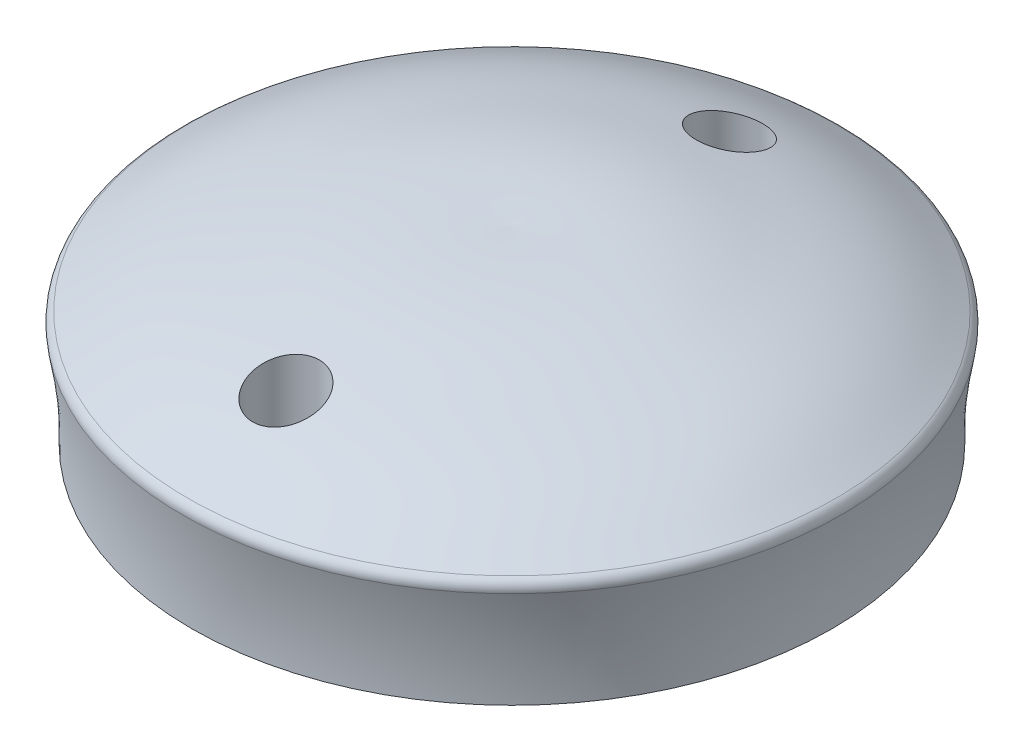
ISO-10303-21;
HEADER;
FILE_DESCRIPTION(('STEP AP214'),'2;1');
FILE_NAME('part.step','',(''),(''),'','','');
FILE_SCHEMA(('AUTOMOTIVE_DESIGN { 1 0 10303 214 1 1 1 1 }'));
ENDSEC;
DATA;
#1=APPLICATION_CONTEXT('core data for automotive mechanical design processes');
#2=APPLICATION_PROTOCOL_DEFINITION('international standard','automotive_design',2000,#1);
#3=PRODUCT_CONTEXT('',#1,'mechanical');
#4=PRODUCT('Part','Part','',(#3));
#5=PRODUCT_RELATED_PRODUCT_CATEGORY('part','',(#4));
#6=PRODUCT_DEFINITION_FORMATION('','',#4);
#7=PRODUCT_DEFINITION_CONTEXT('part definition',#1,'design');
#8=PRODUCT_DEFINITION('design','',#6,#7);
#9=PRODUCT_DEFINITION_SHAPE('','',#8);
#10=(LENGTH_UNIT() NAMED_UNIT(*) SI_UNIT(.MILLI.,.METRE.));
#11=(NAMED_UNIT(*) PLANE_ANGLE_UNIT() SI_UNIT($,.RADIAN.));
#12=(NAMED_UNIT(*) SI_UNIT($,.STERADIAN.) SOLID_ANGLE_UNIT());
#13=UNCERTAINTY_MEASURE_WITH_UNIT(LENGTH_MEASURE(1.E-05),#10,'distance_accuracy_value','');
#14=(GEOMETRIC_REPRESENTATION_CONTEXT(3) GLOBAL_UNCERTAINTY_ASSIGNED_CONTEXT((#13)) GLOBAL_UNIT_ASSIGNED_CONTEXT((#10,
#11,#12)) REPRESENTATION_CONTEXT('',''));
#15=CARTESIAN_POINT('',(0.,0.,0.));
#16=DIRECTION('',(0.,0.,1.));
#17=DIRECTION('',(1.,0.,0.));
#18=AXIS2_PLACEMENT_3D('',#15,#16,#17);
#19=CARTESIAN_POINT('',(0.,10.098852640823,0.));
#20=DIRECTION('',(0.,-1.,0.));
#21=DIRECTION('',(0.,0.,-1.));
#22=AXIS2_PLACEMENT_3D('',#19,#20,#21);
#23=PLANE('',#22);
#24=CARTESIAN_POINT('',(0.,10.098852640823,-20.));
#25=DIRECTION('',(0.,-1.,0.));
#26=DIRECTION('',(0.,0.,-1.));
#27=AXIS2_PLACEMENT_3D('',#24,#25,#26);
#28=CIRCLE('',#27,1.5);
#29=CARTESIAN_POINT('',(0.,10.098852640823,-21.5));
#30=VERTEX_POINT('',#29);
#31=EDGE_CURVE('E149',#30,#30,#28,.T.);
#32=ORIENTED_EDGE('',*,*,#31,.F.);
#33=EDGE_LOOP('',(#32));
#34=FACE_BOUND('',#33,.T.);
#35=CARTESIAN_POINT('',(0.,10.098852640823,-0.38020945273937));
#36=DIRECTION('',(0.,-1.,0.));
#37=DIRECTION('',(0.,0.,-1.));
#38=AXIS2_PLACEMENT_3D('',#35,#36,#37);
#39=CIRCLE('',#38,28.8802398884298);
#40=CARTESIAN_POINT('',(0.,10.098852640823,-29.2604493411692));
#41=VERTEX_POINT('',#40);
#42=EDGE_CURVE('E117',#41,#41,#39,.T.);
#43=ORIENTED_EDGE('',*,*,#42,.T.);
#44=EDGE_LOOP('',(#43));
#45=FACE_BOUND('',#44,.T.);
#46=DIRECTION('',(-1.,0.,0.));
#47=VECTOR('',#46,1.);
#48=CARTESIAN_POINT('',(0.,10.098852640823,12.5));
#49=LINE('',#48,#47);
#50=CARTESIAN_POINT('',(5.15000000000003,10.098852640823,12.5000000000001));
#51=VERTEX_POINT('',#50);
#52=CARTESIAN_POINT('',(-5.14999999999997,10.098852640823,12.5));
#53=VERTEX_POINT('',#52);
#54=EDGE_CURVE('E54',#51,#53,#49,.T.);
#55=ORIENTED_EDGE('',*,*,#54,.F.);
#56=DIRECTION('',(0.,0.,-1.));
#57=VECTOR('',#56,1.);
#58=CARTESIAN_POINT('',(5.15000000000002,10.098852640823,0.));
#59=LINE('',#58,#57);
#60=CARTESIAN_POINT('',(5.15,10.098852640823,-12.5));
#61=VERTEX_POINT('',#60);
#62=EDGE_CURVE('E99',#51,#61,#59,.T.);
#63=ORIENTED_EDGE('',*,*,#62,.T.);
#64=DIRECTION('',(-1.,0.,0.));
#65=VECTOR('',#64,1.);
#66=CARTESIAN_POINT('',(0.,10.098852640823,-12.5));
#67=LINE('',#66,#65);
#68=CARTESIAN_POINT('',(-5.15,10.098852640823,-12.5));
#69=VERTEX_POINT('',#68);
#70=EDGE_CURVE('E102',#61,#69,#67,.T.);
#71=ORIENTED_EDGE('',*,*,#70,.T.);
#72=DIRECTION('',(0.,0.,-1.));
#73=VECTOR('',#72,1.);
#74=CARTESIAN_POINT('',(-5.14999999999998,10.098852640823,0.));
#75=LINE('',#74,#73);
#76=EDGE_CURVE('E111',#53,#69,#75,.T.);
#77=ORIENTED_EDGE('',*,*,#76,.F.);
#78=EDGE_LOOP('',(#55,#63,#71,#77));
#79=FACE_BOUND('',#78,.T.);
#80=CARTESIAN_POINT('',(0.,10.098852640823,20.));
#81=DIRECTION('',(0.,1.,0.));
#82=DIRECTION('',(0.,0.,1.));
#83=AXIS2_PLACEMENT_3D('',#80,#81,#82);
#84=CIRCLE('',#83,1.5);
#85=CARTESIAN_POINT('',(0.,10.098852640823,21.5));
#86=VERTEX_POINT('',#85);
#87=EDGE_CURVE('E105',#86,#86,#84,.T.);
#88=ORIENTED_EDGE('',*,*,#87,.T.);
#89=EDGE_LOOP('',(#88));
#90=FACE_BOUND('',#89,.T.);
#91=ADVANCED_FACE('F33',(#34,#45,#79,#90),#23,.T.);
#92=CARTESIAN_POINT('',(0.,20.098852640823,-30.229832565938));
#93=CARTESIAN_POINT('',(0.,13.3241995111587,-28.7980568454791));
#94=CARTESIAN_POINT('',(0.,7.98026999970867,-29.0428490569546));
#95=CARTESIAN_POINT('',(0.,2.09885264082302,-30.229832565938));
#96=B_SPLINE_CURVE_WITH_KNOTS('',3,(#92,#93,#94,#95),.UNSPECIFIED.,.F.,.F.,(4,4),(0.,1.),.UNSPECIFIED.);
#97=CARTESIAN_POINT('',(0.,5.09885264082302,-0.38020945273937));
#98=DIRECTION('',(0.,-1.,0.));
#99=AXIS1_PLACEMENT('',#97,#98);
#100=SURFACE_OF_REVOLUTION('',#96,#99);
#101=CARTESIAN_POINT('',(0.,19.3945154445513,-0.38020945273937));
#102=DIRECTION('',(0.,-1.,0.));
#103=DIRECTION('',(0.,0.,-1.));
#104=AXIS2_PLACEMENT_3D('',#101,#102,#103);
#105=CIRCLE('',#104,29.70577667632);
#106=CARTESIAN_POINT('',(0.,19.3945154445513,-30.0859861290594));
#107=VERTEX_POINT('',#106);
#108=EDGE_CURVE('E46',#107,#107,#105,.T.);
#109=ORIENTED_EDGE('',*,*,#108,.T.);
#110=EDGE_LOOP('',(#109));
#111=FACE_BOUND('',#110,.T.);
#112=ORIENTED_EDGE('',*,*,#42,.F.);
#113=EDGE_LOOP('',(#112));
#114=FACE_BOUND('',#113,.T.);
#115=ADVANCED_FACE('F132',(#111,#114),#100,.T.);
#116=CARTESIAN_POINT('',(0.,27.098852640823,-0.380209452739368));
#117=CARTESIAN_POINT('',(0.,27.5228355781329,-8.63123930581612));
#118=CARTESIAN_POINT('',(0.,26.2020695400896,-14.3120329402651));
#119=CARTESIAN_POINT('',(0.,23.6366351943411,-24.7475901370865));
#120=CARTESIAN_POINT('',(0.,21.8661140765386,-27.0767556584249));
#121=CARTESIAN_POINT('',(0.,20.098852640823,-30.229832565938));
#122=B_SPLINE_CURVE_WITH_KNOTS('',3,(#116,#117,#118,#119,#120,#121),.UNSPECIFIED.,.F.,.F.,(4,1,
1,4),(0.,0.31883144622687,0.41883144622687,1.),.UNSPECIFIED.);
#123=CARTESIAN_POINT('',(0.,5.09885264082302,-0.38020945273937));
#124=DIRECTION('',(0.,-1.,0.));
#125=AXIS1_PLACEMENT('',#123,#124);
#126=SURFACE_OF_REVOLUTION('',#122,#125);
#127=CARTESIAN_POINT('',(0.,25.3518891747366,17.));
#128=CARTESIAN_POINT('',(0.163658691337124,25.3518864769836,17.0000081087687));
#129=CARTESIAN_POINT('',(0.327441340370548,25.3479796726913,17.0134464806987));
#130=CARTESIAN_POINT('',(0.650402650500698,25.3325060535666,17.0667713226958));
#131=CARTESIAN_POINT('',(0.809575327020766,25.3209297099932,17.1066906931981));
#132=CARTESIAN_POINT('',(1.11849031557255,25.290608448983,17.211534676196));
#133=CARTESIAN_POINT('',(1.26824510550769,25.2718732598214,17.2764253556082));
#134=CARTESIAN_POINT('',(1.55451547389663,25.2279303608176,17.4290470253871));
#135=CARTESIAN_POINT('',(1.69103328559962,25.2027237454155,17.5167741537152));
#136=CARTESIAN_POINT('',(1.94972738934277,25.1461423486314,17.7140676719056));
#137=CARTESIAN_POINT('',(2.07160863759332,25.1146667203167,17.8239915964944));
#138=CARTESIAN_POINT('',(2.29525937948463,25.0467029224839,18.061343930486));
#139=CARTESIAN_POINT('',(2.3970254769226,25.0102139082753,18.188775289664));
#140=CARTESIAN_POINT('',(2.58142157541524,24.9316374676323,18.4623296443043));
#141=CARTESIAN_POINT('',(2.6632350400826,24.8893962667525,18.6089588543293));
#142=CARTESIAN_POINT('',(2.80106106243526,24.8012259324971,18.9128425839703));
#143=CARTESIAN_POINT('',(2.85706896658063,24.7552961357059,19.0700990141441));
#144=CARTESIAN_POINT('',(2.9436877238974,24.6591626549393,19.3965209542171));
#145=CARTESIAN_POINT('',(2.97335279984347,24.6088660802005,19.5659102567752));
#146=CARTESIAN_POINT('',(3.00343153255748,24.5066444355739,19.9067861798967));
#147=CARTESIAN_POINT('',(3.00384045854,24.4547191036706,20.0782731351713));
#148=CARTESIAN_POINT('',(2.97517435422089,24.3491670490634,20.4231259122712));
#149=CARTESIAN_POINT('',(2.94533846072144,24.2955309909042,20.5964260827333));
#150=CARTESIAN_POINT('',(2.85579740353424,24.1893669694019,20.9355082126642));
#151=CARTESIAN_POINT('',(2.79608958470273,24.1368391049924,21.1012895023941));
#152=CARTESIAN_POINT('',(2.64790683817789,24.0343112778919,21.4211901104243));
#153=CARTESIAN_POINT('',(2.55932047782277,23.9843219884435,21.5752613572492));
#154=CARTESIAN_POINT('',(2.35552864058284,23.8888747580491,21.8662874431395));
#155=CARTESIAN_POINT('',(2.24032567212446,23.8434163906732,22.0032438932799));
#156=CARTESIAN_POINT('',(1.98956478573853,23.7600325252199,22.2521114491724));
#157=CARTESIAN_POINT('',(1.8546263154224,23.7219394958054,22.3645895006842));
#158=CARTESIAN_POINT('',(1.56582572068914,23.6535785974848,22.5649650316874));
#159=CARTESIAN_POINT('',(1.41196995624419,23.623308109208,22.6528707400129));
#160=CARTESIAN_POINT('',(1.09806755105517,23.5734657904368,22.7968807819107));
#161=CARTESIAN_POINT('',(0.938731591522964,23.5534288864845,22.8543728689399));
#162=CARTESIAN_POINT('',(0.611810186663395,23.5228755519682,22.941817277323));
#163=CARTESIAN_POINT('',(0.444227558228368,23.5123558939852,22.97177893465));
#164=CARTESIAN_POINT('',(0.114173271020177,23.5016784449135,23.0021856304166));
#165=CARTESIAN_POINT('',(-0.0481611512352768,23.5010505598598,23.0039697797687));
#166=CARTESIAN_POINT('',(-0.37075825510063,23.508982518289,22.9813878981629));
#167=CARTESIAN_POINT('',(-0.531021171793581,23.5175413097987,22.9570248613386));
#168=CARTESIAN_POINT('',(-0.842643629840232,23.5432230630618,22.8836129373046));
#169=CARTESIAN_POINT('',(-0.994096761489794,23.5602237399007,22.834916470145));
#170=CARTESIAN_POINT('',(-1.28652583272764,23.6019257246319,22.7147466353426));
#171=CARTESIAN_POINT('',(-1.42750073239549,23.6266277955947,22.6432710106766));
#172=CARTESIAN_POINT('',(-1.69917474998469,23.6834284918467,22.4776584291821));
#173=CARTESIAN_POINT('',(-1.82949494629713,23.7157083769509,22.3829630845898));
#174=CARTESIAN_POINT('',(-2.07250845580944,23.7859721825833,22.1749278154956));
#175=CARTESIAN_POINT('',(-2.18519781687133,23.8239573782877,22.0615837223285));
#176=CARTESIAN_POINT('',(-2.3957555304959,23.9063110531102,21.8133265056383));
#177=CARTESIAN_POINT('',(-2.49259634243658,23.9509042040239,21.6776164261527));
#178=CARTESIAN_POINT('',(-2.66218657774293,24.0433981165804,21.3929231116851));
#179=CARTESIAN_POINT('',(-2.73493034012154,24.0912996522542,21.2439367682006));
#180=CARTESIAN_POINT('',(-2.85760468099757,24.1912649521012,20.9294498744674));
#181=CARTESIAN_POINT('',(-2.90632264557515,24.2434187374829,20.7635040580631));
#182=CARTESIAN_POINT('',(-2.97460825978181,24.3483125168901,20.4258872525383));
#183=CARTESIAN_POINT('',(-2.9941712439455,24.4010526033772,20.2542153516057));
#184=CARTESIAN_POINT('',(-3.00369192362374,24.5069189025211,19.9059466587082));
#185=CARTESIAN_POINT('',(-2.9929782110606,24.5600274029721,19.7293255455936));
#186=CARTESIAN_POINT('',(-2.94055549528528,24.6640607850249,19.3800691795131));
#187=CARTESIAN_POINT('',(-2.89884659472215,24.7149856738577,19.207433913349));
#188=CARTESIAN_POINT('',(-2.78561328494137,24.8130188855732,18.872431380874));
#189=CARTESIAN_POINT('',(-2.71428760850526,24.8601501933344,18.7100038306142));
#190=CARTESIAN_POINT('',(-2.54345734269019,24.9498149911729,18.3993010914012));
#191=CARTESIAN_POINT('',(-2.44395719981149,24.9923492053021,18.2510236742041));
#192=CARTESIAN_POINT('',(-2.22251965807212,25.0707222338087,17.9775020052255));
#193=CARTESIAN_POINT('',(-2.10129432297398,25.1067160652016,17.8517260262407));
#194=CARTESIAN_POINT('',(-1.83782438673646,25.1724117209895,17.6224211492947));
#195=CARTESIAN_POINT('',(-1.69557859967198,25.2021131901539,17.5188935073425));
#196=CARTESIAN_POINT('',(-1.39964872907436,25.2532304829006,17.3411058844312));
#197=CARTESIAN_POINT('',(-1.24656199830884,25.2749064433233,17.2659252091864));
#198=CARTESIAN_POINT('',(-0.929221275008118,25.310566935512,17.1424768639488));
#199=CARTESIAN_POINT('',(-0.764985077909878,25.324563414437,17.0941673881447));
#200=CARTESIAN_POINT('',(-0.499539561637028,25.3402207665271,17.0401791876237));
#201=CARTESIAN_POINT('',(-0.400296582276039,25.3445886955538,17.0251347091701));
#202=CARTESIAN_POINT('',(-0.200717933801996,25.3504237010646,17.0050427179609));
#203=CARTESIAN_POINT('',(-0.100382284267599,25.3518908294402,16.9999950263764));
#204=CARTESIAN_POINT('',(0.,25.3518891747366,17.));
#205=B_SPLINE_CURVE_WITH_KNOTS('',3,(#127,#128,#129,#130,#131,#132,#133,#134,#135,#136,#137,
#138,#139,#140,#141,#142,#143,#144,#145,#146,#147,#148,#149,#150,#151,#152,#153,#154,#155,#156,
#157,#158,#159,#160,#161,#162,#163,#164,#165,#166,#167,#168,#169,#170,#171,#172,#173,#174,#175,
#176,#177,#178,#179,#180,#181,#182,#183,#184,#185,#186,#187,#188,#189,#190,#191,#192,#193,#194,
#195,#196,#197,#198,#199,#200,#201,#202,#203,#204),.UNSPECIFIED.,.T.,.F.,(4,2,2,2,2,2,2,2,2,2,2,
2,2,2,2,2,2,2,2,2,2,2,2,2,2,2,2,2,2,2,2,2,2,2,2,2,2,2,4),(0.,0.49060109308504,0.981812861627906,
1.47235947464935,1.96282318158852,2.4619278934031,2.96111680123726,3.4781962536881,
3.99536891508133,4.53043555337498,5.06558871295488,5.61454709967005,6.16355428881229,
6.71470549822242,7.26580478671475,7.8023178544309,8.33865103776989,8.8477596778652,
9.35669560795845,9.84136790062947,10.3259846990396,10.8037778371276,11.2816183310325,
11.772325900772,12.2631433106837,12.7785911958137,13.2941600865403,13.8336072045629,
14.3731406372283,14.9247318937988,15.4763213236321,16.0242678367214,16.5721279209285,
17.1045343145321,17.6369707567442,18.1502094490164,18.6626474026873,18.9635696389735,
19.264486492125),.UNSPECIFIED.);
#206=CARTESIAN_POINT('',(0.,25.3518891747366,17.));
#207=VERTEX_POINT('',#206);
#208=EDGE_CURVE('E37',#207,#207,#205,.T.);
#209=ORIENTED_EDGE('',*,*,#208,.T.);
#210=EDGE_LOOP('',(#209));
#211=FACE_BOUND('',#210,.T.);
#212=CARTESIAN_POINT('',(0.,25.5384858846462,-17.));
#213=CARTESIAN_POINT('',(-0.163832199943695,25.5384830195691,-17.0000081137557));
#214=CARTESIAN_POINT('',(-0.327788265649835,25.5346092428274,-17.0134748615955));
#215=CARTESIAN_POINT('',(-0.651089891486491,25.5192839815294,-17.0669138606504));
#216=CARTESIAN_POINT('',(-0.810429459201264,25.5078230714452,-17.1069190808504));
#217=CARTESIAN_POINT('',(-1.11966612195784,25.4778618304688,-17.2119955366231));
#218=CARTESIAN_POINT('',(-1.26957583492831,25.4593711500244,-17.2770324103241));
#219=CARTESIAN_POINT('',(-1.55614677805406,25.4161140526386,-17.4300202338546));
#220=CARTESIAN_POINT('',(-1.6928102132875,25.3913486827199,-17.5179673608457));
#221=CARTESIAN_POINT('',(-1.95181474179462,25.3359319064998,-17.7158268979095));
#222=CARTESIAN_POINT('',(-2.07385660911756,25.3051833179328,-17.8261033939029));
#223=CARTESIAN_POINT('',(-2.2977881107697,25.2390509853322,-18.0643075211403));
#224=CARTESIAN_POINT('',(-2.39967416479807,25.2036664196568,-18.1922382814932));
#225=CARTESIAN_POINT('',(-2.58415044886591,25.1278631541321,-18.466874998796));
#226=CARTESIAN_POINT('',(-2.66594217291268,25.0873117663151,-18.6140807556159));
#227=CARTESIAN_POINT('',(-2.8036038864508,25.0031350529697,-18.9193293092962));
#228=CARTESIAN_POINT('',(-2.85946993983003,24.9595092618338,-19.0773737475393));
#229=CARTESIAN_POINT('',(-2.94539984973518,24.8685899345274,-19.4048935148636));
#230=CARTESIAN_POINT('',(-2.97461922099955,24.8212249254555,-19.5745707995243));
#231=CARTESIAN_POINT('',(-3.00371896174319,24.7251231216745,-19.916044692642));
#232=CARTESIAN_POINT('',(-3.00359516351079,24.6763861330814,-20.0878415986911));
#233=CARTESIAN_POINT('',(-2.97381724137715,24.5777946322928,-20.4323050356679));
#234=CARTESIAN_POINT('',(-2.94357065540256,24.5279373183044,-20.6049198523294));
#235=CARTESIAN_POINT('',(-2.85342438708616,24.4294485608639,-20.9426099463304));
#236=CARTESIAN_POINT('',(-2.79352287125226,24.3808171934045,-21.1076847568003));
#237=CARTESIAN_POINT('',(-2.64536898254375,24.2861833533038,-21.4257823297297));
#238=CARTESIAN_POINT('',(-2.55706987737072,24.2401853622782,-21.5787847047793));
#239=CARTESIAN_POINT('',(-2.3542843391279,24.1524971675197,-21.8677497520356));
#240=CARTESIAN_POINT('',(-2.23980032964553,24.1108065656273,-22.003713999433));
#241=CARTESIAN_POINT('',(-1.99064889687033,24.0343248935418,-22.2510853803921));
#242=CARTESIAN_POINT('',(-1.85653707005768,23.999391249217,-22.3630072478853));
#243=CARTESIAN_POINT('',(-1.56977248493993,23.9367213481479,-22.5624777887835));
#244=CARTESIAN_POINT('',(-1.41712491743341,23.9089830831834,-22.6500332633126));
#245=CARTESIAN_POINT('',(-1.10476179795457,23.8630851393689,-22.7942431484501));
#246=CARTESIAN_POINT('',(-0.945645824823183,23.8445601289142,-22.852079818201));
#247=CARTESIAN_POINT('',(-0.619233085056419,23.8162506931317,-22.9402559808953));
#248=CARTESIAN_POINT('',(-0.451938640399589,23.8064638019608,-22.9706032312177));
#249=CARTESIAN_POINT('',(-0.121180387653639,23.7963478385941,-23.0019657633303));
#250=CARTESIAN_POINT('',(0.0421656472416336,23.7956531103539,-23.0041150796146));
#251=CARTESIAN_POINT('',(0.366845914548174,23.8028118682777,-22.9819278156261));
#252=CARTESIAN_POINT('',(0.52818034728671,23.8106644962562,-22.9575938943663));
#253=CARTESIAN_POINT('',(0.842288142290267,23.83438754473,-22.8837946181683));
#254=CARTESIAN_POINT('',(0.995141273338713,23.8501601507918,-22.834635817783));
#255=CARTESIAN_POINT('',(1.29029159180524,23.8889557913928,-22.7130480791374));
#256=CARTESIAN_POINT('',(1.43258788865679,23.9119794367668,-22.6406171804019));
#257=CARTESIAN_POINT('',(1.70616287756005,23.9649136334877,-22.4729194221247));
#258=CARTESIAN_POINT('',(1.83711864347577,23.9949684874587,-22.3771720656268));
#259=CARTESIAN_POINT('',(2.08119989076229,24.0604862733123,-22.1667007175485));
#260=CARTESIAN_POINT('',(2.19432192857803,24.0959502470594,-22.0519730697638));
#261=CARTESIAN_POINT('',(2.40466788543507,24.1726700359795,-21.8015109454098));
#262=CARTESIAN_POINT('',(2.50100545916125,24.214108635767,-21.6650881149972));
#263=CARTESIAN_POINT('',(2.66947162985018,24.3001697384615,-21.3789497753737));
#264=CARTESIAN_POINT('',(2.74159519965526,24.3447929001981,-21.2292315139984));
#265=CARTESIAN_POINT('',(2.86246120108279,24.4377548256953,-20.9142691448414));
#266=CARTESIAN_POINT('',(2.91015114807176,24.4861708255052,-20.7486433289117));
#267=CARTESIAN_POINT('',(2.9765474696631,24.58367799113,-20.411864915923));
#268=CARTESIAN_POINT('',(2.99524984256337,24.6327692492199,-20.240711559122));
#269=CARTESIAN_POINT('',(3.00323744041287,24.7313547558385,-19.89405566557));
#270=CARTESIAN_POINT('',(2.99191825411804,24.7808369794908,-19.7185353311271));
#271=CARTESIAN_POINT('',(2.93869833553048,24.8778837611161,-19.3716367350907));
#272=CARTESIAN_POINT('',(2.8967974692476,24.925448310686,-19.2002584916487));
#273=CARTESIAN_POINT('',(2.78356712201644,25.0174636002996,-18.8675254918997));
#274=CARTESIAN_POINT('',(2.71237001376712,25.0619273077488,-18.7061293578672));
#275=CARTESIAN_POINT('',(2.54226807903493,25.1469962869371,-18.3975318297393));
#276=CARTESIAN_POINT('',(2.44336639639448,25.1876019957719,-18.2503288275908));
#277=CARTESIAN_POINT('',(2.22290749598063,25.2629863574454,-17.9779469910793));
#278=CARTESIAN_POINT('',(2.10190427664722,25.2978747010397,-17.8523504504641));
#279=CARTESIAN_POINT('',(1.83902871047095,25.3617717716915,-17.6233764379224));
#280=CARTESIAN_POINT('',(1.69715487237415,25.3907800782542,-17.5200005550134));
#281=CARTESIAN_POINT('',(1.40156249559362,25.4409310293296,-17.3421027765317));
#282=CARTESIAN_POINT('',(1.24838339695436,25.4622999796678,-17.2667474613956));
#283=CARTESIAN_POINT('',(0.930848951025687,25.4975120770467,-17.1429979291244));
#284=CARTESIAN_POINT('',(0.766511311326968,25.5113668482386,-17.0945620657251));
#285=CARTESIAN_POINT('',(0.500729141533857,25.5268929361939,-17.0403719966997));
#286=CARTESIAN_POINT('',(0.401251751099111,25.5312318994659,-17.0252552679453));
#287=CARTESIAN_POINT('',(0.201198467938017,25.5370292260956,-17.0050668736057));
#288=CARTESIAN_POINT('',(0.10062259617212,25.5384876443216,-16.9999950166868));
#289=CARTESIAN_POINT('',(0.,25.5384858846462,-17.));
#290=B_SPLINE_CURVE_WITH_KNOTS('',3,(#212,#213,#214,#215,#216,#217,#218,#219,#220,#221,#222,
#223,#224,#225,#226,#227,#228,#229,#230,#231,#232,#233,#234,#235,#236,#237,#238,#239,#240,#241,
#242,#243,#244,#245,#246,#247,#248,#249,#250,#251,#252,#253,#254,#255,#256,#257,#258,#259,#260,
#261,#262,#263,#264,#265,#266,#267,#268,#269,#270,#271,#272,#273,#274,#275,#276,#277,#278,#279,
#280,#281,#282,#283,#284,#285,#286,#287,#288,#289),.UNSPECIFIED.,.T.,.F.,(4,2,2,2,2,2,2,2,2,2,2,
2,2,2,2,2,2,2,2,2,2,2,2,2,2,2,2,2,2,2,2,2,2,2,2,2,2,2,4),(0.,0.491120662437094,
0.982852593983579,1.473911900785,1.96488932114108,2.46463140699749,2.96446218307762,
3.48175566594402,3.99912766016617,4.53237774672494,5.06570357268019,5.60973032719134,
6.153790721753,6.69875106669475,7.243660992321,7.77538173698042,8.30695391906464,
8.81531728133623,9.3235371412319,9.8112522466369,10.2989183881925,10.7807045986748,
11.2625314061708,11.7552819681034,12.2481275601316,12.762041590826,13.2760622512019,
13.8106762022707,14.345363949625,14.8908976381094,15.436433716802,15.9795314400596,
16.5225675589613,17.0535020544518,17.5844745048823,18.0980737494067,18.610876192508,
18.9125188331975,19.214155728174),.UNSPECIFIED.);
#291=CARTESIAN_POINT('',(0.,25.5384858846462,-17.));
#292=VERTEX_POINT('',#291);
#293=EDGE_CURVE('E143',#292,#292,#290,.T.);
#294=ORIENTED_EDGE('',*,*,#293,.T.);
#295=EDGE_LOOP('',(#294));
#296=FACE_BOUND('',#295,.T.);
#297=CARTESIAN_POINT('',(0.,20.4548411320775,-0.38020945273937));
#298=DIRECTION('',(0.,-1.,0.));
#299=DIRECTION('',(0.,0.,-1.));
#300=AXIS2_PLACEMENT_3D('',#297,#298,#299);
#301=CIRCLE('',#300,29.2229307202291);
#302=CARTESIAN_POINT('',(0.,20.4548411320775,-29.6031401729685));
#303=VERTEX_POINT('',#302);
#304=EDGE_CURVE('E11',#303,#303,#301,.F.);
#305=ORIENTED_EDGE('',*,*,#304,.T.);
#306=EDGE_LOOP('',(#305));
#307=FACE_BOUND('',#306,.T.);
#308=CARTESIAN_POINT('',(0.,27.098852640823,-0.38020945273937));
#309=VERTEX_POINT('',#308);
#310=VERTEX_LOOP('',#309);
#311=FACE_BOUND('',#310,.T.);
#312=ADVANCED_FACE('F134',(#211,#296,#307,#311),#126,.T.);
#313=CARTESIAN_POINT('',(0.,16.598852640823,12.5));
#314=DIRECTION('',(0.,0.,1.));
#315=DIRECTION('',(1.,0.,0.));
#316=AXIS2_PLACEMENT_3D('',#313,#314,#315);
#317=PLANE('',#316);
#318=ORIENTED_EDGE('',*,*,#54,.T.);
#319=DIRECTION('',(0.,-1.,0.));
#320=VECTOR('',#319,1.);
#321=CARTESIAN_POINT('',(-5.14999999999997,16.598852640823,12.5));
#322=LINE('',#321,#320);
#323=CARTESIAN_POINT('',(-5.14999999999997,16.598852640823,12.5));
#324=VERTEX_POINT('',#323);
#325=EDGE_CURVE('E78',#324,#53,#322,.T.);
#326=ORIENTED_EDGE('',*,*,#325,.F.);
#327=DIRECTION('',(-1.,0.,0.));
#328=VECTOR('',#327,1.);
#329=CARTESIAN_POINT('',(0.,16.598852640823,12.5));
#330=LINE('',#329,#328);
#331=CARTESIAN_POINT('',(5.15000000000003,16.598852640823,12.5000000000001));
#332=VERTEX_POINT('',#331);
#333=EDGE_CURVE('E82',#332,#324,#330,.T.);
#334=ORIENTED_EDGE('',*,*,#333,.F.);
#335=DIRECTION('',(0.,-1.,0.));
#336=VECTOR('',#335,1.);
#337=CARTESIAN_POINT('',(5.15000000000003,16.598852640823,12.5000000000001));
#338=LINE('',#337,#336);
#339=EDGE_CURVE('E115',#332,#51,#338,.T.);
#340=ORIENTED_EDGE('',*,*,#339,.T.);
#341=EDGE_LOOP('',(#318,#326,#334,#340));
#342=FACE_BOUND('',#341,.T.);
#343=ADVANCED_FACE('F80',(#342),#317,.F.);
#344=CARTESIAN_POINT('',(5.15000000000002,16.598852640823,0.));
#345=DIRECTION('',(-1.,0.,0.));
#346=DIRECTION('',(0.,0.,1.));
#347=AXIS2_PLACEMENT_3D('',#344,#345,#346);
#348=PLANE('',#347);
#349=ORIENTED_EDGE('',*,*,#62,.F.);
#350=ORIENTED_EDGE('',*,*,#339,.F.);
#351=DIRECTION('',(0.,0.,-1.));
#352=VECTOR('',#351,1.);
#353=CARTESIAN_POINT('',(5.15000000000002,16.598852640823,0.));
#354=LINE('',#353,#352);
#355=CARTESIAN_POINT('',(5.15,16.598852640823,-12.5));
#356=VERTEX_POINT('',#355);
#357=EDGE_CURVE('E87',#332,#356,#354,.T.);
#358=ORIENTED_EDGE('',*,*,#357,.T.);
#359=DIRECTION('',(0.,-1.,0.));
#360=VECTOR('',#359,1.);
#361=CARTESIAN_POINT('',(5.15,16.598852640823,-12.5));
#362=LINE('',#361,#360);
#363=EDGE_CURVE('E118',#356,#61,#362,.T.);
#364=ORIENTED_EDGE('',*,*,#363,.T.);
#365=EDGE_LOOP('',(#349,#350,#358,#364));
#366=FACE_BOUND('',#365,.T.);
#367=ADVANCED_FACE('F169',(#366),#348,.T.);
#368=CARTESIAN_POINT('',(0.,16.598852640823,-12.5));
#369=DIRECTION('',(0.,0.,1.));
#370=DIRECTION('',(1.,0.,0.));
#371=AXIS2_PLACEMENT_3D('',#368,#369,#370);
#372=PLANE('',#371);
#373=ORIENTED_EDGE('',*,*,#70,.F.);
#374=ORIENTED_EDGE('',*,*,#363,.F.);
#375=DIRECTION('',(-1.,0.,0.));
#376=VECTOR('',#375,1.);
#377=CARTESIAN_POINT('',(0.,16.598852640823,-12.5));
#378=LINE('',#377,#376);
#379=CARTESIAN_POINT('',(-5.15,16.598852640823,-12.5));
#380=VERTEX_POINT('',#379);
#381=EDGE_CURVE('E95',#356,#380,#378,.T.);
#382=ORIENTED_EDGE('',*,*,#381,.T.);
#383=DIRECTION('',(0.,-1.,0.));
#384=VECTOR('',#383,1.);
#385=CARTESIAN_POINT('',(-5.15,16.598852640823,-12.5));
#386=LINE('',#385,#384);
#387=EDGE_CURVE('E86',#380,#69,#386,.T.);
#388=ORIENTED_EDGE('',*,*,#387,.T.);
#389=EDGE_LOOP('',(#373,#374,#382,#388));
#390=FACE_BOUND('',#389,.T.);
#391=ADVANCED_FACE('F172',(#390),#372,.T.);
#392=CARTESIAN_POINT('',(-5.14999999999998,16.598852640823,0.));
#393=DIRECTION('',(-1.,0.,0.));
#394=DIRECTION('',(0.,0.,1.));
#395=AXIS2_PLACEMENT_3D('',#392,#393,#394);
#396=PLANE('',#395);
#397=ORIENTED_EDGE('',*,*,#76,.T.);
#398=ORIENTED_EDGE('',*,*,#387,.F.);
#399=DIRECTION('',(0.,0.,-1.));
#400=VECTOR('',#399,1.);
#401=CARTESIAN_POINT('',(-5.14999999999998,16.598852640823,0.));
#402=LINE('',#401,#400);
#403=EDGE_CURVE('E91',#324,#380,#402,.T.);
#404=ORIENTED_EDGE('',*,*,#403,.F.);
#405=ORIENTED_EDGE('',*,*,#325,.T.);
#406=EDGE_LOOP('',(#397,#398,#404,#405));
#407=FACE_BOUND('',#406,.T.);
#408=ADVANCED_FACE('F92',(#407),#396,.F.);
#409=CARTESIAN_POINT('',(0.,16.598852640823,0.));
#410=DIRECTION('',(0.,-1.,0.));
#411=DIRECTION('',(0.,0.,-1.));
#412=AXIS2_PLACEMENT_3D('',#409,#410,#411);
#413=PLANE('',#412);
#414=ORIENTED_EDGE('',*,*,#333,.T.);
#415=ORIENTED_EDGE('',*,*,#403,.T.);
#416=ORIENTED_EDGE('',*,*,#381,.F.);
#417=ORIENTED_EDGE('',*,*,#357,.F.);
#418=EDGE_LOOP('',(#414,#415,#416,#417));
#419=FACE_BOUND('',#418,.T.);
#420=ADVANCED_FACE('F98',(#419),#413,.T.);
#421=CARTESIAN_POINT('',(0.,22.098852640823,20.));
#422=DIRECTION('',(0.,-1.,0.));
#423=DIRECTION('',(0.,0.,-1.));
#424=AXIS2_PLACEMENT_3D('',#421,#422,#423);
#425=CYLINDRICAL_SURFACE('',#424,1.5);
#426=CARTESIAN_POINT('',(0.,13.098852640823,20.));
#427=DIRECTION('',(0.,-1.,0.));
#428=DIRECTION('',(0.,0.,-1.));
#429=AXIS2_PLACEMENT_3D('',#426,#427,#428);
#430=CIRCLE('',#429,1.5);
#431=CARTESIAN_POINT('',(0.,13.098852640823,18.5));
#432=VERTEX_POINT('',#431);
#433=EDGE_CURVE('E151',#432,#432,#430,.T.);
#434=ORIENTED_EDGE('',*,*,#433,.F.);
#435=EDGE_LOOP('',(#434));
#436=FACE_BOUND('',#435,.T.);
#437=ORIENTED_EDGE('',*,*,#87,.F.);
#438=EDGE_LOOP('',(#437));
#439=FACE_BOUND('',#438,.T.);
#440=ADVANCED_FACE('F162',(#436,#439),#425,.F.);
#441=CARTESIAN_POINT('',(0.,22.098852640823,-20.));
#442=DIRECTION('',(0.,-1.,0.));
#443=DIRECTION('',(0.,0.,-1.));
#444=AXIS2_PLACEMENT_3D('',#441,#442,#443);
#445=CYLINDRICAL_SURFACE('',#444,1.5);
#446=CARTESIAN_POINT('',(0.,13.098852640823,-20.));
#447=DIRECTION('',(0.,-1.,0.));
#448=DIRECTION('',(0.,0.,-1.));
#449=AXIS2_PLACEMENT_3D('',#446,#447,#448);
#450=CIRCLE('',#449,1.5);
#451=CARTESIAN_POINT('',(0.,13.098852640823,-21.5));
#452=VERTEX_POINT('',#451);
#453=EDGE_CURVE('E150',#452,#452,#450,.F.);
#454=ORIENTED_EDGE('',*,*,#453,.T.);
#455=EDGE_LOOP('',(#454));
#456=FACE_BOUND('',#455,.T.);
#457=ORIENTED_EDGE('',*,*,#31,.T.);
#458=EDGE_LOOP('',(#457));
#459=FACE_BOUND('',#458,.T.);
#460=ADVANCED_FACE('F159',(#456,#459),#445,.F.);
#461=CARTESIAN_POINT('',(0.,19.5878310878324,-0.38020945273937));
#462=DIRECTION('',(0.,1.,0.));
#463=DIRECTION('',(0.,0.,1.));
#464=AXIS2_PLACEMENT_3D('',#461,#462,#463);
#465=TOROIDAL_SURFACE('',#464,28.7246400588896,1.);
#466=ORIENTED_EDGE('',*,*,#304,.F.);
#467=EDGE_LOOP('',(#466));
#468=FACE_BOUND('',#467,.T.);
#469=ORIENTED_EDGE('',*,*,#108,.F.);
#470=EDGE_LOOP('',(#469));
#471=FACE_BOUND('',#470,.T.);
#472=ADVANCED_FACE('F35',(#468,#471),#465,.T.);
#473=CARTESIAN_POINT('',(0.,33.098852640823,-20.));
#474=DIRECTION('',(0.,-1.,0.));
#475=DIRECTION('',(0.,0.,-1.));
#476=AXIS2_PLACEMENT_3D('',#473,#474,#475);
#477=CYLINDRICAL_SURFACE('',#476,3.);
#478=CARTESIAN_POINT('',(0.,13.098852640823,-20.));
#479=DIRECTION('',(0.,-1.,0.));
#480=DIRECTION('',(0.,0.,-1.));
#481=AXIS2_PLACEMENT_3D('',#478,#479,#480);
#482=CIRCLE('',#481,3.);
#483=CARTESIAN_POINT('',(0.,13.098852640823,-23.));
#484=VERTEX_POINT('',#483);
#485=EDGE_CURVE('E199',#484,#484,#482,.T.);
#486=ORIENTED_EDGE('',*,*,#485,.T.);
#487=EDGE_LOOP('',(#486));
#488=FACE_BOUND('',#487,.T.);
#489=ORIENTED_EDGE('',*,*,#293,.F.);
#490=EDGE_LOOP('',(#489));
#491=FACE_BOUND('',#490,.T.);
#492=ADVANCED_FACE('F152',(#488,#491),#477,.F.);
#493=CARTESIAN_POINT('',(0.,13.098852640823,-20.));
#494=DIRECTION('',(0.,-1.,0.));
#495=DIRECTION('',(0.,0.,-1.));
#496=AXIS2_PLACEMENT_3D('',#493,#494,#495);
#497=PLANE('',#496);
#498=ORIENTED_EDGE('',*,*,#485,.F.);
#499=EDGE_LOOP('',(#498));
#500=FACE_BOUND('',#499,.T.);
#501=ORIENTED_EDGE('',*,*,#453,.F.);
#502=EDGE_LOOP('',(#501));
#503=FACE_BOUND('',#502,.T.);
#504=ADVANCED_FACE('F157',(#500,#503),#497,.F.);
#505=CARTESIAN_POINT('',(0.,33.098852640823,20.));
#506=DIRECTION('',(0.,-1.,0.));
#507=DIRECTION('',(0.,0.,-1.));
#508=AXIS2_PLACEMENT_3D('',#505,#506,#507);
#509=CYLINDRICAL_SURFACE('',#508,3.);
#510=CARTESIAN_POINT('',(0.,13.098852640823,20.));
#511=DIRECTION('',(0.,-1.,0.));
#512=DIRECTION('',(0.,0.,-1.));
#513=AXIS2_PLACEMENT_3D('',#510,#511,#512);
#514=CIRCLE('',#513,3.);
#515=CARTESIAN_POINT('',(0.,13.098852640823,17.));
#516=VERTEX_POINT('',#515);
#517=EDGE_CURVE('E202',#516,#516,#514,.T.);
#518=ORIENTED_EDGE('',*,*,#517,.T.);
#519=EDGE_LOOP('',(#518));
#520=FACE_BOUND('',#519,.T.);
#521=ORIENTED_EDGE('',*,*,#208,.F.);
#522=EDGE_LOOP('',(#521));
#523=FACE_BOUND('',#522,.T.);
#524=ADVANCED_FACE('F213',(#520,#523),#509,.F.);
#525=CARTESIAN_POINT('',(0.,13.098852640823,20.));
#526=DIRECTION('',(0.,-1.,0.));
#527=DIRECTION('',(0.,0.,-1.));
#528=AXIS2_PLACEMENT_3D('',#525,#526,#527);
#529=PLANE('',#528);
#530=ORIENTED_EDGE('',*,*,#433,.T.);
#531=EDGE_LOOP('',(#530));
#532=FACE_BOUND('',#531,.T.);
#533=ORIENTED_EDGE('',*,*,#517,.F.);
#534=EDGE_LOOP('',(#533));
#535=FACE_BOUND('',#534,.T.);
#536=ADVANCED_FACE('F215',(#532,#535),#529,.F.);
#537=CLOSED_SHELL('',(#91,#115,#312,#343,#367,#391,#408,#420,#440,#460,#472,#492,#504,#524,#536));
#538=MANIFOLD_SOLID_BREP('B2',#537);
#539=ADVANCED_BREP_SHAPE_REPRESENTATION('',(#18,#538),#14);
#540=SHAPE_DEFINITION_REPRESENTATION(#9,#539);
ENDSEC;
END-ISO-10303-21;
